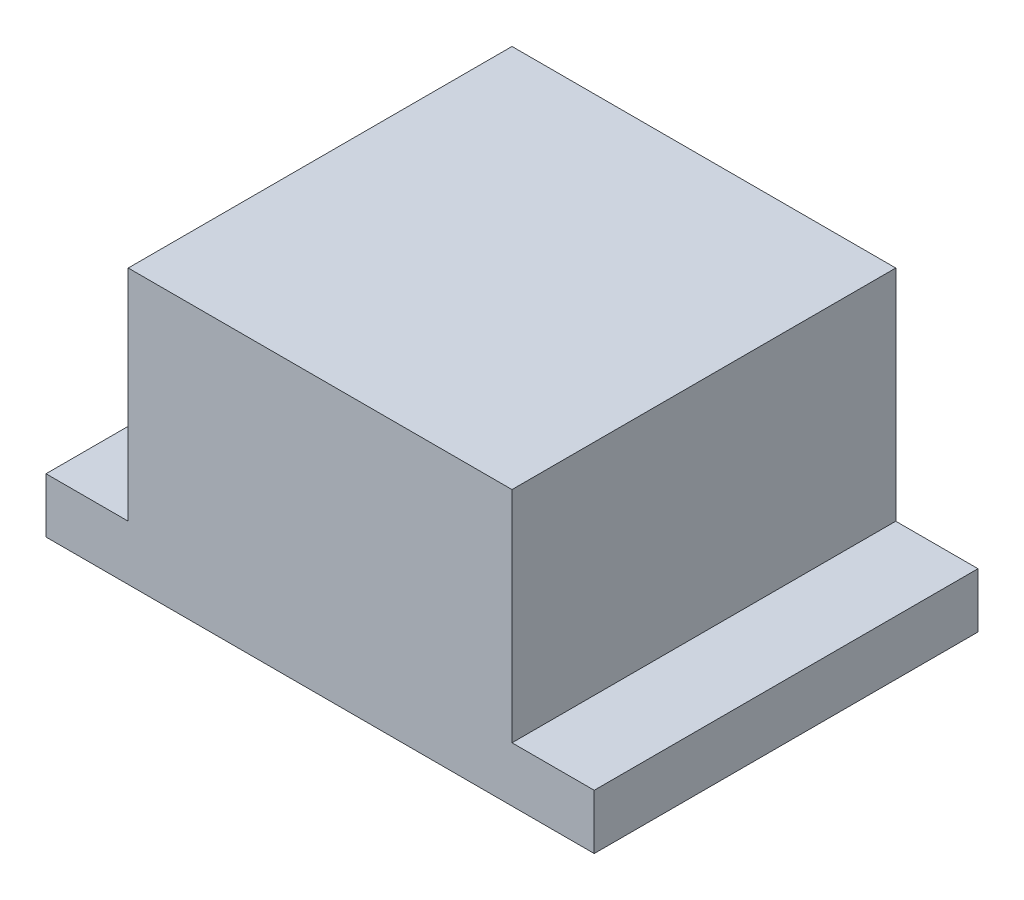
ISO-10303-21;
HEADER;
FILE_DESCRIPTION(('STEP AP214'),'2;1');
FILE_NAME('part.step','',(''),(''),'','','');
FILE_SCHEMA(('AUTOMOTIVE_DESIGN { 1 0 10303 214 1 1 1 1 }'));
ENDSEC;
DATA;
#1=APPLICATION_CONTEXT('core data for automotive mechanical design processes');
#2=APPLICATION_PROTOCOL_DEFINITION('international standard','automotive_design',2000,#1);
#3=PRODUCT_CONTEXT('',#1,'mechanical');
#4=PRODUCT('Part','Part','',(#3));
#5=PRODUCT_RELATED_PRODUCT_CATEGORY('part','',(#4));
#6=PRODUCT_DEFINITION_FORMATION('','',#4);
#7=PRODUCT_DEFINITION_CONTEXT('part definition',#1,'design');
#8=PRODUCT_DEFINITION('design','',#6,#7);
#9=PRODUCT_DEFINITION_SHAPE('','',#8);
#10=(LENGTH_UNIT() NAMED_UNIT(*) SI_UNIT(.MILLI.,.METRE.));
#11=(NAMED_UNIT(*) PLANE_ANGLE_UNIT() SI_UNIT($,.RADIAN.));
#12=(NAMED_UNIT(*) SI_UNIT($,.STERADIAN.) SOLID_ANGLE_UNIT());
#13=UNCERTAINTY_MEASURE_WITH_UNIT(LENGTH_MEASURE(1.E-05),#10,'distance_accuracy_value','');
#14=(GEOMETRIC_REPRESENTATION_CONTEXT(3) GLOBAL_UNCERTAINTY_ASSIGNED_CONTEXT((#13)) GLOBAL_UNIT_ASSIGNED_CONTEXT((#10,
#11,#12)) REPRESENTATION_CONTEXT('',''));
#15=CARTESIAN_POINT('',(0.,0.,0.));
#16=DIRECTION('',(0.,0.,1.));
#17=DIRECTION('',(1.,0.,0.));
#18=AXIS2_PLACEMENT_3D('',#15,#16,#17);
#19=CARTESIAN_POINT('',(-2.5,0.499999999999999,3.5));
#20=DIRECTION('',(1.,0.,0.));
#21=DIRECTION('',(0.,0.,-1.));
#22=AXIS2_PLACEMENT_3D('',#19,#20,#21);
#23=PLANE('',#22);
#24=DIRECTION('',(0.,-1.,0.));
#25=VECTOR('',#24,1.);
#26=CARTESIAN_POINT('',(-2.5,0.499999999999999,0.));
#27=LINE('',#26,#25);
#28=CARTESIAN_POINT('',(-2.5,0.499999999999999,0.));
#29=VERTEX_POINT('',#28);
#30=CARTESIAN_POINT('',(-2.5,0.,0.));
#31=VERTEX_POINT('',#30);
#32=EDGE_CURVE('E127',#29,#31,#27,.T.);
#33=ORIENTED_EDGE('',*,*,#32,.T.);
#34=DIRECTION('',(0.,0.,-1.));
#35=VECTOR('',#34,1.);
#36=CARTESIAN_POINT('',(-2.5,0.,3.5));
#37=LINE('',#36,#35);
#38=CARTESIAN_POINT('',(-2.5,0.,3.5));
#39=VERTEX_POINT('',#38);
#40=EDGE_CURVE('E11',#39,#31,#37,.T.);
#41=ORIENTED_EDGE('',*,*,#40,.F.);
#42=DIRECTION('',(0.,-1.,0.));
#43=VECTOR('',#42,1.);
#44=CARTESIAN_POINT('',(-2.5,0.499999999999999,3.5));
#45=LINE('',#44,#43);
#46=CARTESIAN_POINT('',(-2.5,0.499999999999999,3.5));
#47=VERTEX_POINT('',#46);
#48=EDGE_CURVE('E141',#47,#39,#45,.T.);
#49=ORIENTED_EDGE('',*,*,#48,.F.);
#50=DIRECTION('',(0.,0.,-1.));
#51=VECTOR('',#50,1.);
#52=CARTESIAN_POINT('',(-2.5,0.499999999999999,3.5));
#53=LINE('',#52,#51);
#54=EDGE_CURVE('E123',#47,#29,#53,.T.);
#55=ORIENTED_EDGE('',*,*,#54,.T.);
#56=EDGE_LOOP('',(#33,#41,#49,#55));
#57=FACE_BOUND('',#56,.T.);
#58=ADVANCED_FACE('F31',(#57),#23,.F.);
#59=CARTESIAN_POINT('',(-2.5,0.,3.5));
#60=DIRECTION('',(0.,1.,0.));
#61=DIRECTION('',(0.,0.,1.));
#62=AXIS2_PLACEMENT_3D('',#59,#60,#61);
#63=PLANE('',#62);
#64=DIRECTION('',(1.,0.,0.));
#65=VECTOR('',#64,1.);
#66=CARTESIAN_POINT('',(-2.5,0.,0.));
#67=LINE('',#66,#65);
#68=CARTESIAN_POINT('',(2.5,0.,0.));
#69=VERTEX_POINT('',#68);
#70=EDGE_CURVE('E130',#31,#69,#67,.T.);
#71=ORIENTED_EDGE('',*,*,#70,.T.);
#72=DIRECTION('',(0.,0.,-1.));
#73=VECTOR('',#72,1.);
#74=CARTESIAN_POINT('',(2.5,0.,3.5));
#75=LINE('',#74,#73);
#76=CARTESIAN_POINT('',(2.5,0.,3.5));
#77=VERTEX_POINT('',#76);
#78=EDGE_CURVE('E39',#77,#69,#75,.T.);
#79=ORIENTED_EDGE('',*,*,#78,.F.);
#80=DIRECTION('',(1.,0.,0.));
#81=VECTOR('',#80,1.);
#82=CARTESIAN_POINT('',(-2.5,0.,3.5));
#83=LINE('',#82,#81);
#84=EDGE_CURVE('E90',#39,#77,#83,.T.);
#85=ORIENTED_EDGE('',*,*,#84,.F.);
#86=ORIENTED_EDGE('',*,*,#40,.T.);
#87=EDGE_LOOP('',(#71,#79,#85,#86));
#88=FACE_BOUND('',#87,.T.);
#89=ADVANCED_FACE('F176',(#88),#63,.F.);
#90=CARTESIAN_POINT('',(2.5,0.,3.5));
#91=DIRECTION('',(-1.,0.,0.));
#92=DIRECTION('',(0.,0.,1.));
#93=AXIS2_PLACEMENT_3D('',#90,#91,#92);
#94=PLANE('',#93);
#95=DIRECTION('',(0.,1.,0.));
#96=VECTOR('',#95,1.);
#97=CARTESIAN_POINT('',(2.5,0.,0.));
#98=LINE('',#97,#96);
#99=CARTESIAN_POINT('',(2.5,0.499999999999999,0.));
#100=VERTEX_POINT('',#99);
#101=EDGE_CURVE('E132',#69,#100,#98,.T.);
#102=ORIENTED_EDGE('',*,*,#101,.T.);
#103=DIRECTION('',(0.,0.,-1.));
#104=VECTOR('',#103,1.);
#105=CARTESIAN_POINT('',(2.5,0.499999999999999,3.5));
#106=LINE('',#105,#104);
#107=CARTESIAN_POINT('',(2.5,0.499999999999999,3.5));
#108=VERTEX_POINT('',#107);
#109=EDGE_CURVE('E148',#108,#100,#106,.T.);
#110=ORIENTED_EDGE('',*,*,#109,.F.);
#111=DIRECTION('',(0.,1.,0.));
#112=VECTOR('',#111,1.);
#113=CARTESIAN_POINT('',(2.5,0.,3.5));
#114=LINE('',#113,#112);
#115=EDGE_CURVE('E156',#77,#108,#114,.T.);
#116=ORIENTED_EDGE('',*,*,#115,.F.);
#117=ORIENTED_EDGE('',*,*,#78,.T.);
#118=EDGE_LOOP('',(#102,#110,#116,#117));
#119=FACE_BOUND('',#118,.T.);
#120=ADVANCED_FACE('F154',(#119),#94,.F.);
#121=CARTESIAN_POINT('',(2.5,0.499999999999999,3.5));
#122=DIRECTION('',(0.,-1.,0.));
#123=DIRECTION('',(1.,0.,0.));
#124=AXIS2_PLACEMENT_3D('',#121,#122,#123);
#125=PLANE('',#124);
#126=DIRECTION('',(-1.,0.,0.));
#127=VECTOR('',#126,1.);
#128=CARTESIAN_POINT('',(2.5,0.499999999999999,0.));
#129=LINE('',#128,#127);
#130=CARTESIAN_POINT('',(1.75,0.499999999999999,0.));
#131=VERTEX_POINT('',#130);
#132=EDGE_CURVE('E134',#100,#131,#129,.T.);
#133=ORIENTED_EDGE('',*,*,#132,.T.);
#134=DIRECTION('',(0.,0.,-1.));
#135=VECTOR('',#134,1.);
#136=CARTESIAN_POINT('',(1.75,0.499999999999999,3.5));
#137=LINE('',#136,#135);
#138=CARTESIAN_POINT('',(1.75,0.499999999999999,3.5));
#139=VERTEX_POINT('',#138);
#140=EDGE_CURVE('E145',#139,#131,#137,.T.);
#141=ORIENTED_EDGE('',*,*,#140,.F.);
#142=DIRECTION('',(-1.,0.,0.));
#143=VECTOR('',#142,1.);
#144=CARTESIAN_POINT('',(2.5,0.499999999999999,3.5));
#145=LINE('',#144,#143);
#146=EDGE_CURVE('E168',#108,#139,#145,.T.);
#147=ORIENTED_EDGE('',*,*,#146,.F.);
#148=ORIENTED_EDGE('',*,*,#109,.T.);
#149=EDGE_LOOP('',(#133,#141,#147,#148));
#150=FACE_BOUND('',#149,.T.);
#151=ADVANCED_FACE('F164',(#150),#125,.F.);
#152=CARTESIAN_POINT('',(1.75,0.499999999999999,3.5));
#153=DIRECTION('',(-1.,0.,0.));
#154=DIRECTION('',(0.,0.,1.));
#155=AXIS2_PLACEMENT_3D('',#152,#153,#154);
#156=PLANE('',#155);
#157=DIRECTION('',(0.,1.,0.));
#158=VECTOR('',#157,1.);
#159=CARTESIAN_POINT('',(1.75,0.499999999999999,0.));
#160=LINE('',#159,#158);
#161=CARTESIAN_POINT('',(1.75,2.5,0.));
#162=VERTEX_POINT('',#161);
#163=EDGE_CURVE('E136',#131,#162,#160,.T.);
#164=ORIENTED_EDGE('',*,*,#163,.T.);
#165=DIRECTION('',(0.,0.,-1.));
#166=VECTOR('',#165,1.);
#167=CARTESIAN_POINT('',(1.75,2.5,3.5));
#168=LINE('',#167,#166);
#169=CARTESIAN_POINT('',(1.75,2.5,3.5));
#170=VERTEX_POINT('',#169);
#171=EDGE_CURVE('E118',#170,#162,#168,.T.);
#172=ORIENTED_EDGE('',*,*,#171,.F.);
#173=DIRECTION('',(0.,1.,0.));
#174=VECTOR('',#173,1.);
#175=CARTESIAN_POINT('',(1.75,0.499999999999999,3.5));
#176=LINE('',#175,#174);
#177=EDGE_CURVE('E109',#139,#170,#176,.T.);
#178=ORIENTED_EDGE('',*,*,#177,.F.);
#179=ORIENTED_EDGE('',*,*,#140,.T.);
#180=EDGE_LOOP('',(#164,#172,#178,#179));
#181=FACE_BOUND('',#180,.T.);
#182=ADVANCED_FACE('F167',(#181),#156,.F.);
#183=CARTESIAN_POINT('',(1.75,2.5,3.5));
#184=DIRECTION('',(0.,-1.,0.));
#185=DIRECTION('',(0.,0.,-1.));
#186=AXIS2_PLACEMENT_3D('',#183,#184,#185);
#187=PLANE('',#186);
#188=DIRECTION('',(-1.,0.,0.));
#189=VECTOR('',#188,1.);
#190=CARTESIAN_POINT('',(1.75,2.5,0.));
#191=LINE('',#190,#189);
#192=CARTESIAN_POINT('',(-1.75,2.5,0.));
#193=VERTEX_POINT('',#192);
#194=EDGE_CURVE('E117',#162,#193,#191,.T.);
#195=ORIENTED_EDGE('',*,*,#194,.T.);
#196=DIRECTION('',(0.,0.,-1.));
#197=VECTOR('',#196,1.);
#198=CARTESIAN_POINT('',(-1.75,2.5,3.5));
#199=LINE('',#198,#197);
#200=CARTESIAN_POINT('',(-1.75,2.5,3.5));
#201=VERTEX_POINT('',#200);
#202=EDGE_CURVE('E114',#201,#193,#199,.T.);
#203=ORIENTED_EDGE('',*,*,#202,.F.);
#204=DIRECTION('',(-1.,0.,0.));
#205=VECTOR('',#204,1.);
#206=CARTESIAN_POINT('',(1.75,2.5,3.5));
#207=LINE('',#206,#205);
#208=EDGE_CURVE('E103',#170,#201,#207,.T.);
#209=ORIENTED_EDGE('',*,*,#208,.F.);
#210=ORIENTED_EDGE('',*,*,#171,.T.);
#211=EDGE_LOOP('',(#195,#203,#209,#210));
#212=FACE_BOUND('',#211,.T.);
#213=ADVANCED_FACE('F115',(#212),#187,.F.);
#214=CARTESIAN_POINT('',(-1.75,2.5,3.5));
#215=DIRECTION('',(1.,0.,0.));
#216=DIRECTION('',(0.,0.,-1.));
#217=AXIS2_PLACEMENT_3D('',#214,#215,#216);
#218=PLANE('',#217);
#219=DIRECTION('',(0.,-1.,0.));
#220=VECTOR('',#219,1.);
#221=CARTESIAN_POINT('',(-1.75,2.5,0.));
#222=LINE('',#221,#220);
#223=CARTESIAN_POINT('',(-1.75,0.499999999999999,0.));
#224=VERTEX_POINT('',#223);
#225=EDGE_CURVE('E76',#193,#224,#222,.T.);
#226=ORIENTED_EDGE('',*,*,#225,.T.);
#227=DIRECTION('',(0.,0.,-1.));
#228=VECTOR('',#227,1.);
#229=CARTESIAN_POINT('',(-1.75,0.499999999999999,3.5));
#230=LINE('',#229,#228);
#231=CARTESIAN_POINT('',(-1.75,0.499999999999999,3.5));
#232=VERTEX_POINT('',#231);
#233=EDGE_CURVE('E119',#232,#224,#230,.T.);
#234=ORIENTED_EDGE('',*,*,#233,.F.);
#235=DIRECTION('',(0.,-1.,0.));
#236=VECTOR('',#235,1.);
#237=CARTESIAN_POINT('',(-1.75,2.5,3.5));
#238=LINE('',#237,#236);
#239=EDGE_CURVE('E107',#201,#232,#238,.T.);
#240=ORIENTED_EDGE('',*,*,#239,.F.);
#241=ORIENTED_EDGE('',*,*,#202,.T.);
#242=EDGE_LOOP('',(#226,#234,#240,#241));
#243=FACE_BOUND('',#242,.T.);
#244=ADVANCED_FACE('F121',(#243),#218,.F.);
#245=CARTESIAN_POINT('',(-1.75,0.499999999999999,3.5));
#246=DIRECTION('',(0.,-1.,0.));
#247=DIRECTION('',(1.,0.,0.));
#248=AXIS2_PLACEMENT_3D('',#245,#246,#247);
#249=PLANE('',#248);
#250=DIRECTION('',(-1.,0.,0.));
#251=VECTOR('',#250,1.);
#252=CARTESIAN_POINT('',(-1.75,0.499999999999999,0.));
#253=LINE('',#252,#251);
#254=EDGE_CURVE('E82',#224,#29,#253,.T.);
#255=ORIENTED_EDGE('',*,*,#254,.T.);
#256=ORIENTED_EDGE('',*,*,#54,.F.);
#257=DIRECTION('',(-1.,0.,0.));
#258=VECTOR('',#257,1.);
#259=CARTESIAN_POINT('',(-1.75,0.499999999999999,3.5));
#260=LINE('',#259,#258);
#261=EDGE_CURVE('E47',#232,#47,#260,.T.);
#262=ORIENTED_EDGE('',*,*,#261,.F.);
#263=ORIENTED_EDGE('',*,*,#233,.T.);
#264=EDGE_LOOP('',(#255,#256,#262,#263));
#265=FACE_BOUND('',#264,.T.);
#266=ADVANCED_FACE('F192',(#265),#249,.F.);
#267=CARTESIAN_POINT('',(-2.5,0.,3.5));
#268=DIRECTION('',(0.,0.,1.));
#269=DIRECTION('',(1.,0.,0.));
#270=AXIS2_PLACEMENT_3D('',#267,#268,#269);
#271=PLANE('',#270);
#272=ORIENTED_EDGE('',*,*,#48,.T.);
#273=ORIENTED_EDGE('',*,*,#84,.T.);
#274=ORIENTED_EDGE('',*,*,#115,.T.);
#275=ORIENTED_EDGE('',*,*,#146,.T.);
#276=ORIENTED_EDGE('',*,*,#177,.T.);
#277=ORIENTED_EDGE('',*,*,#208,.T.);
#278=ORIENTED_EDGE('',*,*,#239,.T.);
#279=ORIENTED_EDGE('',*,*,#261,.T.);
#280=EDGE_LOOP('',(#272,#273,#274,#275,#276,#277,#278,#279));
#281=FACE_BOUND('',#280,.T.);
#282=ADVANCED_FACE('F105',(#281),#271,.T.);
#283=CARTESIAN_POINT('',(-2.5,0.,0.));
#284=DIRECTION('',(0.,0.,1.));
#285=DIRECTION('',(1.,0.,0.));
#286=AXIS2_PLACEMENT_3D('',#283,#284,#285);
#287=PLANE('',#286);
#288=ORIENTED_EDGE('',*,*,#32,.F.);
#289=ORIENTED_EDGE('',*,*,#254,.F.);
#290=ORIENTED_EDGE('',*,*,#225,.F.);
#291=ORIENTED_EDGE('',*,*,#194,.F.);
#292=ORIENTED_EDGE('',*,*,#163,.F.);
#293=ORIENTED_EDGE('',*,*,#132,.F.);
#294=ORIENTED_EDGE('',*,*,#101,.F.);
#295=ORIENTED_EDGE('',*,*,#70,.F.);
#296=EDGE_LOOP('',(#288,#289,#290,#291,#292,#293,#294,#295));
#297=FACE_BOUND('',#296,.T.);
#298=ADVANCED_FACE('F160',(#297),#287,.F.);
#299=CLOSED_SHELL('',(#58,#89,#120,#151,#182,#213,#244,#266,#282,#298));
#300=MANIFOLD_SOLID_BREP('B2',#299);
#301=ADVANCED_BREP_SHAPE_REPRESENTATION('',(#18,#300),#14);
#302=SHAPE_DEFINITION_REPRESENTATION(#9,#301);
ENDSEC;
END-ISO-10303-21;
